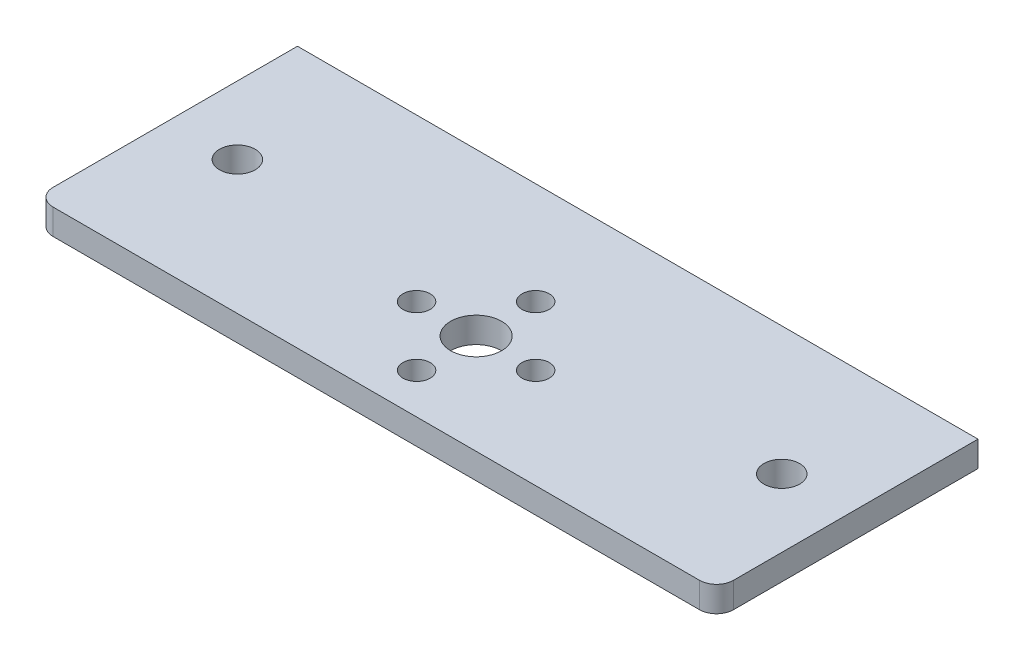
ISO-10303-21;
HEADER;
FILE_DESCRIPTION(('STEP AP214'),'2;1');
FILE_NAME('part.step','',(''),(''),'','','');
FILE_SCHEMA(('AUTOMOTIVE_DESIGN { 1 0 10303 214 1 1 1 1 }'));
ENDSEC;
DATA;
#1=APPLICATION_CONTEXT('core data for automotive mechanical design processes');
#2=APPLICATION_PROTOCOL_DEFINITION('international standard','automotive_design',2000,#1);
#3=PRODUCT_CONTEXT('',#1,'mechanical');
#4=PRODUCT('Part','Part','',(#3));
#5=PRODUCT_RELATED_PRODUCT_CATEGORY('part','',(#4));
#6=PRODUCT_DEFINITION_FORMATION('','',#4);
#7=PRODUCT_DEFINITION_CONTEXT('part definition',#1,'design');
#8=PRODUCT_DEFINITION('design','',#6,#7);
#9=PRODUCT_DEFINITION_SHAPE('','',#8);
#10=(LENGTH_UNIT() NAMED_UNIT(*) SI_UNIT(.MILLI.,.METRE.));
#11=(NAMED_UNIT(*) PLANE_ANGLE_UNIT() SI_UNIT($,.RADIAN.));
#12=(NAMED_UNIT(*) SI_UNIT($,.STERADIAN.) SOLID_ANGLE_UNIT());
#13=UNCERTAINTY_MEASURE_WITH_UNIT(LENGTH_MEASURE(1.E-05),#10,'distance_accuracy_value','');
#14=(GEOMETRIC_REPRESENTATION_CONTEXT(3) GLOBAL_UNCERTAINTY_ASSIGNED_CONTEXT((#13)) GLOBAL_UNIT_ASSIGNED_CONTEXT((#10,
#11,#12)) REPRESENTATION_CONTEXT('',''));
#15=CARTESIAN_POINT('',(0.,0.,0.));
#16=DIRECTION('',(0.,0.,1.));
#17=DIRECTION('',(1.,0.,0.));
#18=AXIS2_PLACEMENT_3D('',#15,#16,#17);
#19=CARTESIAN_POINT('',(-40.,-3.,-19.));
#20=DIRECTION('',(-1.,0.,0.));
#21=DIRECTION('',(0.,0.,1.));
#22=AXIS2_PLACEMENT_3D('',#19,#20,#21);
#23=PLANE('',#22);
#24=DIRECTION('',(0.,0.,1.));
#25=VECTOR('',#24,1.);
#26=CARTESIAN_POINT('',(-40.,-3.,-19.));
#27=LINE('',#26,#25);
#28=CARTESIAN_POINT('',(-40.,-3.,-19.));
#29=VERTEX_POINT('',#28);
#30=CARTESIAN_POINT('',(-40.,-3.,9.73999999999999));
#31=VERTEX_POINT('',#30);
#32=EDGE_CURVE('E105',#29,#31,#27,.T.);
#33=ORIENTED_EDGE('',*,*,#32,.T.);
#34=DIRECTION('',(0.,1.,0.));
#35=VECTOR('',#34,1.);
#36=CARTESIAN_POINT('',(-40.,-3.,9.74));
#37=LINE('',#36,#35);
#38=CARTESIAN_POINT('',(-40.,0.,9.73999999999999));
#39=VERTEX_POINT('',#38);
#40=EDGE_CURVE('E119',#31,#39,#37,.T.);
#41=ORIENTED_EDGE('',*,*,#40,.T.);
#42=DIRECTION('',(0.,0.,1.));
#43=VECTOR('',#42,1.);
#44=CARTESIAN_POINT('',(-40.,0.,-19.));
#45=LINE('',#44,#43);
#46=CARTESIAN_POINT('',(-40.,0.,-19.));
#47=VERTEX_POINT('',#46);
#48=EDGE_CURVE('E109',#47,#39,#45,.T.);
#49=ORIENTED_EDGE('',*,*,#48,.F.);
#50=DIRECTION('',(0.,1.,0.));
#51=VECTOR('',#50,1.);
#52=CARTESIAN_POINT('',(-40.,-3.,-19.));
#53=LINE('',#52,#51);
#54=EDGE_CURVE('E100',#29,#47,#53,.T.);
#55=ORIENTED_EDGE('',*,*,#54,.F.);
#56=EDGE_LOOP('',(#33,#41,#49,#55));
#57=FACE_BOUND('',#56,.T.);
#58=ADVANCED_FACE('F35',(#57),#23,.T.);
#59=CARTESIAN_POINT('',(-40.,-3.,-19.));
#60=DIRECTION('',(0.,0.,-1.));
#61=DIRECTION('',(-1.,0.,0.));
#62=AXIS2_PLACEMENT_3D('',#59,#60,#61);
#63=PLANE('',#62);
#64=DIRECTION('',(-1.,0.,0.));
#65=VECTOR('',#64,1.);
#66=CARTESIAN_POINT('',(-40.,0.,-19.));
#67=LINE('',#66,#65);
#68=CARTESIAN_POINT('',(40.,0.,-19.));
#69=VERTEX_POINT('',#68);
#70=EDGE_CURVE('E99',#69,#47,#67,.T.);
#71=ORIENTED_EDGE('',*,*,#70,.F.);
#72=DIRECTION('',(0.,1.,0.));
#73=VECTOR('',#72,1.);
#74=CARTESIAN_POINT('',(40.,-3.,-19.));
#75=LINE('',#74,#73);
#76=CARTESIAN_POINT('',(40.,-3.,-19.));
#77=VERTEX_POINT('',#76);
#78=EDGE_CURVE('E89',#77,#69,#75,.T.);
#79=ORIENTED_EDGE('',*,*,#78,.F.);
#80=DIRECTION('',(-1.,0.,0.));
#81=VECTOR('',#80,1.);
#82=CARTESIAN_POINT('',(-40.,-3.,-19.));
#83=LINE('',#82,#81);
#84=EDGE_CURVE('E92',#77,#29,#83,.T.);
#85=ORIENTED_EDGE('',*,*,#84,.T.);
#86=ORIENTED_EDGE('',*,*,#54,.T.);
#87=EDGE_LOOP('',(#71,#79,#85,#86));
#88=FACE_BOUND('',#87,.T.);
#89=ADVANCED_FACE('F97',(#88),#63,.T.);
#90=CARTESIAN_POINT('',(40.,-3.,-19.));
#91=DIRECTION('',(1.,0.,0.));
#92=DIRECTION('',(0.,0.,-1.));
#93=AXIS2_PLACEMENT_3D('',#90,#91,#92);
#94=PLANE('',#93);
#95=DIRECTION('',(0.,0.,-1.));
#96=VECTOR('',#95,1.);
#97=CARTESIAN_POINT('',(40.,0.,-19.));
#98=LINE('',#97,#96);
#99=CARTESIAN_POINT('',(40.,0.,9.73999999999998));
#100=VERTEX_POINT('',#99);
#101=EDGE_CURVE('E116',#100,#69,#98,.T.);
#102=ORIENTED_EDGE('',*,*,#101,.F.);
#103=DIRECTION('',(0.,1.,0.));
#104=VECTOR('',#103,1.);
#105=CARTESIAN_POINT('',(40.,-3.,9.73999999999999));
#106=LINE('',#105,#104);
#107=CARTESIAN_POINT('',(40.,-3.,9.73999999999998));
#108=VERTEX_POINT('',#107);
#109=EDGE_CURVE('E11',#100,#108,#106,.F.);
#110=ORIENTED_EDGE('',*,*,#109,.T.);
#111=DIRECTION('',(0.,0.,-1.));
#112=VECTOR('',#111,1.);
#113=CARTESIAN_POINT('',(40.,-3.,-19.));
#114=LINE('',#113,#112);
#115=EDGE_CURVE('E86',#108,#77,#114,.T.);
#116=ORIENTED_EDGE('',*,*,#115,.T.);
#117=ORIENTED_EDGE('',*,*,#78,.T.);
#118=EDGE_LOOP('',(#102,#110,#116,#117));
#119=FACE_BOUND('',#118,.T.);
#120=ADVANCED_FACE('F88',(#119),#94,.T.);
#121=CARTESIAN_POINT('',(-40.,-3.,11.74));
#122=DIRECTION('',(0.,0.,1.));
#123=DIRECTION('',(1.,0.,0.));
#124=AXIS2_PLACEMENT_3D('',#121,#122,#123);
#125=PLANE('',#124);
#126=DIRECTION('',(1.,0.,0.));
#127=VECTOR('',#126,1.);
#128=CARTESIAN_POINT('',(-40.,0.,11.74));
#129=LINE('',#128,#127);
#130=CARTESIAN_POINT('',(-38.,0.,11.74));
#131=VERTEX_POINT('',#130);
#132=CARTESIAN_POINT('',(38.,0.,11.74));
#133=VERTEX_POINT('',#132);
#134=EDGE_CURVE('E112',#131,#133,#129,.T.);
#135=ORIENTED_EDGE('',*,*,#134,.F.);
#136=DIRECTION('',(0.,1.,0.));
#137=VECTOR('',#136,1.);
#138=CARTESIAN_POINT('',(-38.,-3.,11.74));
#139=LINE('',#138,#137);
#140=CARTESIAN_POINT('',(-38.,-3.,11.74));
#141=VERTEX_POINT('',#140);
#142=EDGE_CURVE('E130',#131,#141,#139,.F.);
#143=ORIENTED_EDGE('',*,*,#142,.T.);
#144=DIRECTION('',(1.,0.,0.));
#145=VECTOR('',#144,1.);
#146=CARTESIAN_POINT('',(-40.,-3.,11.74));
#147=LINE('',#146,#145);
#148=CARTESIAN_POINT('',(38.,-3.,11.74));
#149=VERTEX_POINT('',#148);
#150=EDGE_CURVE('E93',#141,#149,#147,.T.);
#151=ORIENTED_EDGE('',*,*,#150,.T.);
#152=DIRECTION('',(0.,1.,0.));
#153=VECTOR('',#152,1.);
#154=CARTESIAN_POINT('',(38.,-3.,11.74));
#155=LINE('',#154,#153);
#156=EDGE_CURVE('E127',#149,#133,#155,.T.);
#157=ORIENTED_EDGE('',*,*,#156,.T.);
#158=EDGE_LOOP('',(#135,#143,#151,#157));
#159=FACE_BOUND('',#158,.T.);
#160=ADVANCED_FACE('F144',(#159),#125,.T.);
#161=CARTESIAN_POINT('',(0.,-3.,0.));
#162=DIRECTION('',(0.,1.,0.));
#163=DIRECTION('',(0.,0.,1.));
#164=AXIS2_PLACEMENT_3D('',#161,#162,#163);
#165=PLANE('',#164);
#166=CARTESIAN_POINT('',(31.999,-3.,-3.93));
#167=DIRECTION('',(0.,1.,0.));
#168=DIRECTION('',(0.,0.,1.));
#169=AXIS2_PLACEMENT_3D('',#166,#167,#168);
#170=CIRCLE('',#169,2.1);
#171=CARTESIAN_POINT('',(31.999,-3.,-1.83));
#172=VERTEX_POINT('',#171);
#173=EDGE_CURVE('E203',#172,#172,#170,.T.);
#174=ORIENTED_EDGE('',*,*,#173,.T.);
#175=EDGE_LOOP('',(#174));
#176=FACE_BOUND('',#175,.T.);
#177=CARTESIAN_POINT('',(-31.999,-3.,-3.93));
#178=DIRECTION('',(0.,1.,0.));
#179=DIRECTION('',(0.,0.,1.));
#180=AXIS2_PLACEMENT_3D('',#177,#178,#179);
#181=CIRCLE('',#180,2.1);
#182=CARTESIAN_POINT('',(-31.999,-3.,-1.83));
#183=VERTEX_POINT('',#182);
#184=EDGE_CURVE('E205',#183,#183,#181,.T.);
#185=ORIENTED_EDGE('',*,*,#184,.T.);
#186=EDGE_LOOP('',(#185));
#187=FACE_BOUND('',#186,.T.);
#188=CARTESIAN_POINT('',(7.,-3.,0.));
#189=DIRECTION('',(0.,1.,0.));
#190=DIRECTION('',(0.,0.,1.));
#191=AXIS2_PLACEMENT_3D('',#188,#189,#190);
#192=CIRCLE('',#191,1.6);
#193=CARTESIAN_POINT('',(7.,-3.,1.6));
#194=VERTEX_POINT('',#193);
#195=EDGE_CURVE('E208',#194,#194,#192,.T.);
#196=ORIENTED_EDGE('',*,*,#195,.T.);
#197=EDGE_LOOP('',(#196));
#198=FACE_BOUND('',#197,.T.);
#199=CARTESIAN_POINT('',(0.,-3.,7.));
#200=DIRECTION('',(0.,1.,0.));
#201=DIRECTION('',(0.,0.,1.));
#202=AXIS2_PLACEMENT_3D('',#199,#200,#201);
#203=CIRCLE('',#202,1.6);
#204=CARTESIAN_POINT('',(0.,-3.,8.6));
#205=VERTEX_POINT('',#204);
#206=EDGE_CURVE('E217',#205,#205,#203,.T.);
#207=ORIENTED_EDGE('',*,*,#206,.T.);
#208=EDGE_LOOP('',(#207));
#209=FACE_BOUND('',#208,.T.);
#210=CARTESIAN_POINT('',(-7.,-3.,0.));
#211=DIRECTION('',(0.,1.,0.));
#212=DIRECTION('',(0.,0.,1.));
#213=AXIS2_PLACEMENT_3D('',#210,#211,#212);
#214=CIRCLE('',#213,1.6);
#215=CARTESIAN_POINT('',(-7.,-3.,1.6));
#216=VERTEX_POINT('',#215);
#217=EDGE_CURVE('E223',#216,#216,#214,.T.);
#218=ORIENTED_EDGE('',*,*,#217,.T.);
#219=EDGE_LOOP('',(#218));
#220=FACE_BOUND('',#219,.T.);
#221=CARTESIAN_POINT('',(0.,-3.,-7.));
#222=DIRECTION('',(0.,1.,0.));
#223=DIRECTION('',(0.,0.,1.));
#224=AXIS2_PLACEMENT_3D('',#221,#222,#223);
#225=CIRCLE('',#224,1.6);
#226=CARTESIAN_POINT('',(0.,-3.,-5.4));
#227=VERTEX_POINT('',#226);
#228=EDGE_CURVE('E229',#227,#227,#225,.T.);
#229=ORIENTED_EDGE('',*,*,#228,.T.);
#230=EDGE_LOOP('',(#229));
#231=FACE_BOUND('',#230,.T.);
#232=CARTESIAN_POINT('',(0.,-3.,0.));
#233=DIRECTION('',(0.,1.,0.));
#234=DIRECTION('',(0.,0.,1.));
#235=AXIS2_PLACEMENT_3D('',#232,#233,#234);
#236=CIRCLE('',#235,3.);
#237=CARTESIAN_POINT('',(0.,-3.,3.));
#238=VERTEX_POINT('',#237);
#239=EDGE_CURVE('E113',#238,#238,#236,.T.);
#240=ORIENTED_EDGE('',*,*,#239,.T.);
#241=EDGE_LOOP('',(#240));
#242=FACE_BOUND('',#241,.T.);
#243=ORIENTED_EDGE('',*,*,#150,.F.);
#244=CARTESIAN_POINT('',(-38.,-3.,9.74));
#245=DIRECTION('',(0.,1.,0.));
#246=DIRECTION('',(0.,0.,1.));
#247=AXIS2_PLACEMENT_3D('',#244,#245,#246);
#248=CIRCLE('',#247,2.);
#249=EDGE_CURVE('E43',#141,#31,#248,.F.);
#250=ORIENTED_EDGE('',*,*,#249,.T.);
#251=ORIENTED_EDGE('',*,*,#32,.F.);
#252=ORIENTED_EDGE('',*,*,#84,.F.);
#253=ORIENTED_EDGE('',*,*,#115,.F.);
#254=CARTESIAN_POINT('',(38.,-3.,9.73999999999999));
#255=DIRECTION('',(0.,1.,0.));
#256=DIRECTION('',(0.,0.,1.));
#257=AXIS2_PLACEMENT_3D('',#254,#255,#256);
#258=CIRCLE('',#257,2.);
#259=EDGE_CURVE('E55',#108,#149,#258,.F.);
#260=ORIENTED_EDGE('',*,*,#259,.T.);
#261=EDGE_LOOP('',(#243,#250,#251,#252,#253,#260));
#262=FACE_BOUND('',#261,.T.);
#263=ADVANCED_FACE('F103',(#176,#187,#198,#209,#220,#231,#242,#262),#165,.F.);
#264=CARTESIAN_POINT('',(0.,0.,0.));
#265=DIRECTION('',(0.,1.,0.));
#266=DIRECTION('',(0.,0.,1.));
#267=AXIS2_PLACEMENT_3D('',#264,#265,#266);
#268=PLANE('',#267);
#269=CARTESIAN_POINT('',(31.999,0.,-3.93));
#270=DIRECTION('',(0.,1.,0.));
#271=DIRECTION('',(0.,0.,1.));
#272=AXIS2_PLACEMENT_3D('',#269,#270,#271);
#273=CIRCLE('',#272,2.1);
#274=CARTESIAN_POINT('',(31.999,0.,-1.83));
#275=VERTEX_POINT('',#274);
#276=EDGE_CURVE('E200',#275,#275,#273,.T.);
#277=ORIENTED_EDGE('',*,*,#276,.F.);
#278=EDGE_LOOP('',(#277));
#279=FACE_BOUND('',#278,.T.);
#280=CARTESIAN_POINT('',(-31.999,0.,-3.93));
#281=DIRECTION('',(0.,1.,0.));
#282=DIRECTION('',(0.,0.,1.));
#283=AXIS2_PLACEMENT_3D('',#280,#281,#282);
#284=CIRCLE('',#283,2.1);
#285=CARTESIAN_POINT('',(-31.999,0.,-1.83));
#286=VERTEX_POINT('',#285);
#287=EDGE_CURVE('E263',#286,#286,#284,.T.);
#288=ORIENTED_EDGE('',*,*,#287,.F.);
#289=EDGE_LOOP('',(#288));
#290=FACE_BOUND('',#289,.T.);
#291=CARTESIAN_POINT('',(7.,0.,0.));
#292=DIRECTION('',(0.,1.,0.));
#293=DIRECTION('',(0.,0.,1.));
#294=AXIS2_PLACEMENT_3D('',#291,#292,#293);
#295=CIRCLE('',#294,1.6);
#296=CARTESIAN_POINT('',(7.,0.,1.6));
#297=VERTEX_POINT('',#296);
#298=EDGE_CURVE('E204',#297,#297,#295,.T.);
#299=ORIENTED_EDGE('',*,*,#298,.F.);
#300=EDGE_LOOP('',(#299));
#301=FACE_BOUND('',#300,.T.);
#302=CARTESIAN_POINT('',(0.,0.,7.));
#303=DIRECTION('',(0.,1.,0.));
#304=DIRECTION('',(0.,0.,1.));
#305=AXIS2_PLACEMENT_3D('',#302,#303,#304);
#306=CIRCLE('',#305,1.6);
#307=CARTESIAN_POINT('',(0.,0.,8.6));
#308=VERTEX_POINT('',#307);
#309=EDGE_CURVE('E215',#308,#308,#306,.T.);
#310=ORIENTED_EDGE('',*,*,#309,.F.);
#311=EDGE_LOOP('',(#310));
#312=FACE_BOUND('',#311,.T.);
#313=CARTESIAN_POINT('',(-7.,0.,0.));
#314=DIRECTION('',(0.,1.,0.));
#315=DIRECTION('',(0.,0.,1.));
#316=AXIS2_PLACEMENT_3D('',#313,#314,#315);
#317=CIRCLE('',#316,1.6);
#318=CARTESIAN_POINT('',(-7.,0.,1.6));
#319=VERTEX_POINT('',#318);
#320=EDGE_CURVE('E220',#319,#319,#317,.T.);
#321=ORIENTED_EDGE('',*,*,#320,.F.);
#322=EDGE_LOOP('',(#321));
#323=FACE_BOUND('',#322,.T.);
#324=CARTESIAN_POINT('',(0.,0.,-7.));
#325=DIRECTION('',(0.,1.,0.));
#326=DIRECTION('',(0.,0.,1.));
#327=AXIS2_PLACEMENT_3D('',#324,#325,#326);
#328=CIRCLE('',#327,1.6);
#329=CARTESIAN_POINT('',(0.,0.,-5.4));
#330=VERTEX_POINT('',#329);
#331=EDGE_CURVE('E226',#330,#330,#328,.T.);
#332=ORIENTED_EDGE('',*,*,#331,.F.);
#333=EDGE_LOOP('',(#332));
#334=FACE_BOUND('',#333,.T.);
#335=CARTESIAN_POINT('',(0.,0.,0.));
#336=DIRECTION('',(0.,1.,0.));
#337=DIRECTION('',(0.,0.,1.));
#338=AXIS2_PLACEMENT_3D('',#335,#336,#337);
#339=CIRCLE('',#338,3.);
#340=CARTESIAN_POINT('',(0.,0.,3.));
#341=VERTEX_POINT('',#340);
#342=EDGE_CURVE('E232',#341,#341,#339,.T.);
#343=ORIENTED_EDGE('',*,*,#342,.F.);
#344=EDGE_LOOP('',(#343));
#345=FACE_BOUND('',#344,.T.);
#346=ORIENTED_EDGE('',*,*,#48,.T.);
#347=CARTESIAN_POINT('',(-38.,0.,9.74));
#348=DIRECTION('',(0.,1.,0.));
#349=DIRECTION('',(0.,0.,1.));
#350=AXIS2_PLACEMENT_3D('',#347,#348,#349);
#351=CIRCLE('',#350,2.);
#352=EDGE_CURVE('E125',#39,#131,#351,.T.);
#353=ORIENTED_EDGE('',*,*,#352,.T.);
#354=ORIENTED_EDGE('',*,*,#134,.T.);
#355=CARTESIAN_POINT('',(38.,0.,9.73999999999999));
#356=DIRECTION('',(0.,1.,0.));
#357=DIRECTION('',(0.,0.,1.));
#358=AXIS2_PLACEMENT_3D('',#355,#356,#357);
#359=CIRCLE('',#358,2.);
#360=EDGE_CURVE('E123',#133,#100,#359,.T.);
#361=ORIENTED_EDGE('',*,*,#360,.T.);
#362=ORIENTED_EDGE('',*,*,#101,.T.);
#363=ORIENTED_EDGE('',*,*,#70,.T.);
#364=EDGE_LOOP('',(#346,#353,#354,#361,#362,#363));
#365=FACE_BOUND('',#364,.T.);
#366=ADVANCED_FACE('F142',(#279,#290,#301,#312,#323,#334,#345,#365),#268,.T.);
#367=CARTESIAN_POINT('',(0.,-3.,0.));
#368=DIRECTION('',(0.,1.,0.));
#369=DIRECTION('',(0.,0.,1.));
#370=AXIS2_PLACEMENT_3D('',#367,#368,#369);
#371=CYLINDRICAL_SURFACE('',#370,3.);
#372=ORIENTED_EDGE('',*,*,#239,.F.);
#373=EDGE_LOOP('',(#372));
#374=FACE_BOUND('',#373,.T.);
#375=ORIENTED_EDGE('',*,*,#342,.T.);
#376=EDGE_LOOP('',(#375));
#377=FACE_BOUND('',#376,.T.);
#378=ADVANCED_FACE('F165',(#374,#377),#371,.F.);
#379=CARTESIAN_POINT('',(0.,-3.,-7.));
#380=DIRECTION('',(0.,1.,0.));
#381=DIRECTION('',(0.,0.,1.));
#382=AXIS2_PLACEMENT_3D('',#379,#380,#381);
#383=CYLINDRICAL_SURFACE('',#382,1.6);
#384=ORIENTED_EDGE('',*,*,#228,.F.);
#385=EDGE_LOOP('',(#384));
#386=FACE_BOUND('',#385,.T.);
#387=ORIENTED_EDGE('',*,*,#331,.T.);
#388=EDGE_LOOP('',(#387));
#389=FACE_BOUND('',#388,.T.);
#390=ADVANCED_FACE('F172',(#386,#389),#383,.F.);
#391=CARTESIAN_POINT('',(-7.,-3.,0.));
#392=DIRECTION('',(0.,1.,0.));
#393=DIRECTION('',(0.,0.,1.));
#394=AXIS2_PLACEMENT_3D('',#391,#392,#393);
#395=CYLINDRICAL_SURFACE('',#394,1.6);
#396=ORIENTED_EDGE('',*,*,#217,.F.);
#397=EDGE_LOOP('',(#396));
#398=FACE_BOUND('',#397,.T.);
#399=ORIENTED_EDGE('',*,*,#320,.T.);
#400=EDGE_LOOP('',(#399));
#401=FACE_BOUND('',#400,.T.);
#402=ADVANCED_FACE('F176',(#398,#401),#395,.F.);
#403=CARTESIAN_POINT('',(0.,-3.,7.));
#404=DIRECTION('',(0.,1.,0.));
#405=DIRECTION('',(0.,0.,1.));
#406=AXIS2_PLACEMENT_3D('',#403,#404,#405);
#407=CYLINDRICAL_SURFACE('',#406,1.6);
#408=ORIENTED_EDGE('',*,*,#206,.F.);
#409=EDGE_LOOP('',(#408));
#410=FACE_BOUND('',#409,.T.);
#411=ORIENTED_EDGE('',*,*,#309,.T.);
#412=EDGE_LOOP('',(#411));
#413=FACE_BOUND('',#412,.T.);
#414=ADVANCED_FACE('F180',(#410,#413),#407,.F.);
#415=CARTESIAN_POINT('',(7.,-3.,0.));
#416=DIRECTION('',(0.,1.,0.));
#417=DIRECTION('',(0.,0.,1.));
#418=AXIS2_PLACEMENT_3D('',#415,#416,#417);
#419=CYLINDRICAL_SURFACE('',#418,1.6);
#420=ORIENTED_EDGE('',*,*,#195,.F.);
#421=EDGE_LOOP('',(#420));
#422=FACE_BOUND('',#421,.T.);
#423=ORIENTED_EDGE('',*,*,#298,.T.);
#424=EDGE_LOOP('',(#423));
#425=FACE_BOUND('',#424,.T.);
#426=ADVANCED_FACE('F184',(#422,#425),#419,.F.);
#427=CARTESIAN_POINT('',(-31.999,-10.,-3.93));
#428=DIRECTION('',(0.,1.,0.));
#429=DIRECTION('',(0.,0.,1.));
#430=AXIS2_PLACEMENT_3D('',#427,#428,#429);
#431=CYLINDRICAL_SURFACE('',#430,2.1);
#432=ORIENTED_EDGE('',*,*,#287,.T.);
#433=EDGE_LOOP('',(#432));
#434=FACE_BOUND('',#433,.T.);
#435=ORIENTED_EDGE('',*,*,#184,.F.);
#436=EDGE_LOOP('',(#435));
#437=FACE_BOUND('',#436,.T.);
#438=ADVANCED_FACE('F188',(#434,#437),#431,.F.);
#439=CARTESIAN_POINT('',(31.999,-10.,-3.93));
#440=DIRECTION('',(0.,1.,0.));
#441=DIRECTION('',(0.,0.,1.));
#442=AXIS2_PLACEMENT_3D('',#439,#440,#441);
#443=CYLINDRICAL_SURFACE('',#442,2.1);
#444=ORIENTED_EDGE('',*,*,#276,.T.);
#445=EDGE_LOOP('',(#444));
#446=FACE_BOUND('',#445,.T.);
#447=ORIENTED_EDGE('',*,*,#173,.F.);
#448=EDGE_LOOP('',(#447));
#449=FACE_BOUND('',#448,.T.);
#450=ADVANCED_FACE('F151',(#446,#449),#443,.F.);
#451=CARTESIAN_POINT('',(-38.,-3.,9.74));
#452=DIRECTION('',(0.,1.,0.));
#453=DIRECTION('',(0.,0.,1.));
#454=AXIS2_PLACEMENT_3D('',#451,#452,#453);
#455=CYLINDRICAL_SURFACE('',#454,2.);
#456=ORIENTED_EDGE('',*,*,#249,.F.);
#457=ORIENTED_EDGE('',*,*,#142,.F.);
#458=ORIENTED_EDGE('',*,*,#352,.F.);
#459=ORIENTED_EDGE('',*,*,#40,.F.);
#460=EDGE_LOOP('',(#456,#457,#458,#459));
#461=FACE_BOUND('',#460,.T.);
#462=ADVANCED_FACE('F139',(#461),#455,.T.);
#463=CARTESIAN_POINT('',(38.,-3.,9.73999999999999));
#464=DIRECTION('',(0.,1.,0.));
#465=DIRECTION('',(0.,0.,1.));
#466=AXIS2_PLACEMENT_3D('',#463,#464,#465);
#467=CYLINDRICAL_SURFACE('',#466,2.);
#468=ORIENTED_EDGE('',*,*,#259,.F.);
#469=ORIENTED_EDGE('',*,*,#109,.F.);
#470=ORIENTED_EDGE('',*,*,#360,.F.);
#471=ORIENTED_EDGE('',*,*,#156,.F.);
#472=EDGE_LOOP('',(#468,#469,#470,#471));
#473=FACE_BOUND('',#472,.T.);
#474=ADVANCED_FACE('F37',(#473),#467,.T.);
#475=CLOSED_SHELL('',(#58,#89,#120,#160,#263,#366,#378,#390,#402,#414,#426,#438,#450,#462,#474));
#476=MANIFOLD_SOLID_BREP('B2',#475);
#477=ADVANCED_BREP_SHAPE_REPRESENTATION('',(#18,#476),#14);
#478=SHAPE_DEFINITION_REPRESENTATION(#9,#477);
ENDSEC;
END-ISO-10303-21;
